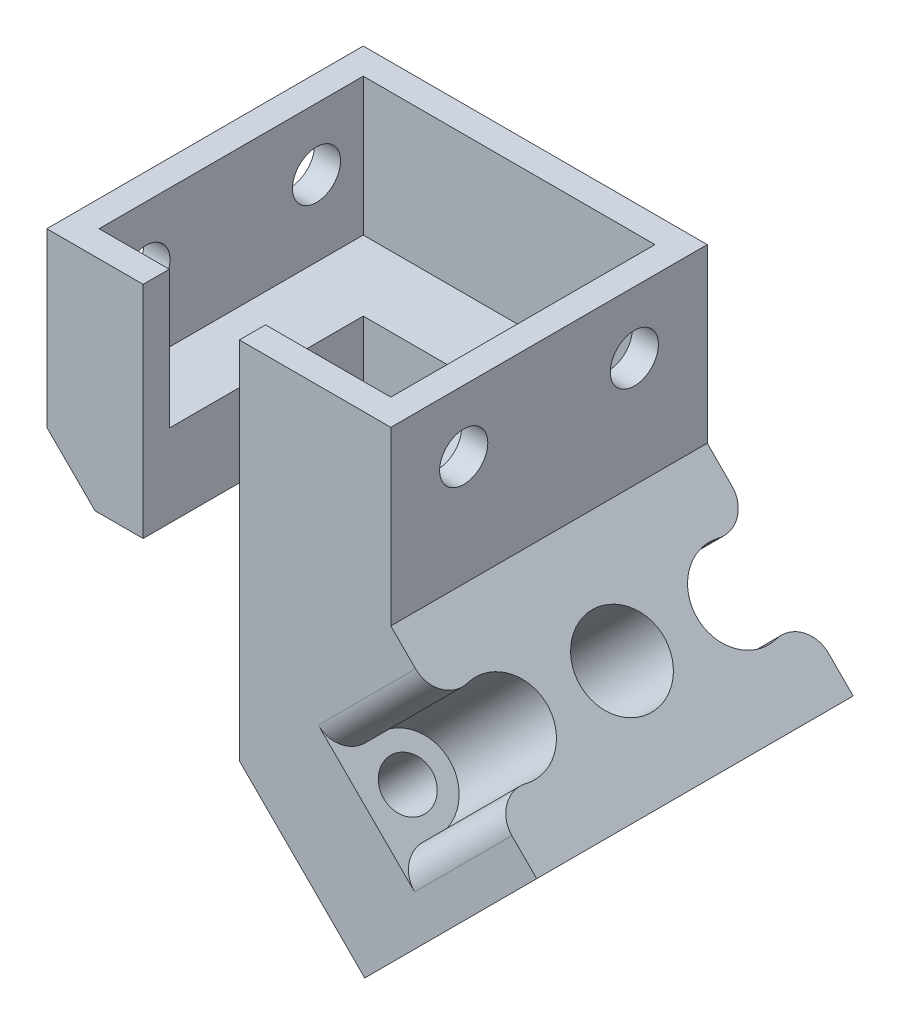
ISO-10303-21;
HEADER;
FILE_DESCRIPTION(('STEP AP214'),'2;1');
FILE_NAME('part.step','',(''),(''),'','','');
FILE_SCHEMA(('AUTOMOTIVE_DESIGN { 1 0 10303 214 1 1 1 1 }'));
ENDSEC;
DATA;
#1=APPLICATION_CONTEXT('core data for automotive mechanical design processes');
#2=APPLICATION_PROTOCOL_DEFINITION('international standard','automotive_design',2000,#1);
#3=PRODUCT_CONTEXT('',#1,'mechanical');
#4=PRODUCT('Part','Part','',(#3));
#5=PRODUCT_RELATED_PRODUCT_CATEGORY('part','',(#4));
#6=PRODUCT_DEFINITION_FORMATION('','',#4);
#7=PRODUCT_DEFINITION_CONTEXT('part definition',#1,'design');
#8=PRODUCT_DEFINITION('design','',#6,#7);
#9=PRODUCT_DEFINITION_SHAPE('','',#8);
#10=(LENGTH_UNIT() NAMED_UNIT(*) SI_UNIT(.MILLI.,.METRE.));
#11=(NAMED_UNIT(*) PLANE_ANGLE_UNIT() SI_UNIT($,.RADIAN.));
#12=(NAMED_UNIT(*) SI_UNIT($,.STERADIAN.) SOLID_ANGLE_UNIT());
#13=UNCERTAINTY_MEASURE_WITH_UNIT(LENGTH_MEASURE(1.E-05),#10,'distance_accuracy_value','');
#14=(GEOMETRIC_REPRESENTATION_CONTEXT(3) GLOBAL_UNCERTAINTY_ASSIGNED_CONTEXT((#13)) GLOBAL_UNIT_ASSIGNED_CONTEXT((#10,
#11,#12)) REPRESENTATION_CONTEXT('',''));
#15=CARTESIAN_POINT('',(0.,0.,0.));
#16=DIRECTION('',(0.,0.,1.));
#17=DIRECTION('',(1.,0.,0.));
#18=AXIS2_PLACEMENT_3D('',#15,#16,#17);
#19=CARTESIAN_POINT('',(0.,12.5,0.));
#20=DIRECTION('',(0.,0.,-1.));
#21=DIRECTION('',(-1.,0.,0.));
#22=AXIS2_PLACEMENT_3D('',#19,#20,#21);
#23=PLANE('',#22);
#24=DIRECTION('',(0.707106781186544,-0.707106781186551,0.));
#25=VECTOR('',#24,1.);
#26=CARTESIAN_POINT('',(0.,0.,0.));
#27=LINE('',#26,#25);
#28=CARTESIAN_POINT('',(0.,0.,0.));
#29=VERTEX_POINT('',#28);
#30=CARTESIAN_POINT('',(3.5,-3.5,0.));
#31=VERTEX_POINT('',#30);
#32=EDGE_CURVE('E371',#29,#31,#27,.T.);
#33=ORIENTED_EDGE('',*,*,#32,.T.);
#34=DIRECTION('',(-1.,0.,0.));
#35=VECTOR('',#34,1.);
#36=CARTESIAN_POINT('',(14.,-3.5,0.));
#37=LINE('',#36,#35);
#38=CARTESIAN_POINT('',(6.99999999999999,-3.5,0.));
#39=VERTEX_POINT('',#38);
#40=EDGE_CURVE('E219',#39,#31,#37,.T.);
#41=ORIENTED_EDGE('',*,*,#40,.F.);
#42=DIRECTION('',(0.,1.,0.));
#43=VECTOR('',#42,1.);
#44=CARTESIAN_POINT('',(6.99999999999999,-3.5,0.));
#45=LINE('',#44,#43);
#46=CARTESIAN_POINT('',(6.99999999999999,12.5,0.));
#47=VERTEX_POINT('',#46);
#48=EDGE_CURVE('E345',#39,#47,#45,.T.);
#49=ORIENTED_EDGE('',*,*,#48,.T.);
#50=DIRECTION('',(1.,0.,0.));
#51=VECTOR('',#50,1.);
#52=CARTESIAN_POINT('',(0.,12.5,0.));
#53=LINE('',#52,#51);
#54=CARTESIAN_POINT('',(0.,12.5,0.));
#55=VERTEX_POINT('',#54);
#56=EDGE_CURVE('E431',#55,#47,#53,.T.);
#57=ORIENTED_EDGE('',*,*,#56,.F.);
#58=DIRECTION('',(0.,-1.,0.));
#59=VECTOR('',#58,1.);
#60=CARTESIAN_POINT('',(0.,12.5,0.));
#61=LINE('',#60,#59);
#62=EDGE_CURVE('E459',#55,#29,#61,.T.);
#63=ORIENTED_EDGE('',*,*,#62,.T.);
#64=EDGE_LOOP('',(#33,#41,#49,#57,#63));
#65=FACE_BOUND('',#64,.T.);
#66=ADVANCED_FACE('F44',(#65),#23,.F.);
#67=CARTESIAN_POINT('',(6.24999999999981,-29.3566017177981,-11.5));
#68=DIRECTION('',(0.707106781186551,0.707106781186544,0.));
#69=DIRECTION('',(-0.707106781186544,0.707106781186551,0.));
#70=AXIS2_PLACEMENT_3D('',#67,#68,#69);
#71=CYLINDRICAL_SURFACE('',#70,1.75);
#72=CARTESIAN_POINT('',(17.803300858899,-17.8033008588991,-11.5));
#73=DIRECTION('',(-0.707106781186551,-0.707106781186544,0.));
#74=DIRECTION('',(0.707106781186544,-0.707106781186551,0.));
#75=AXIS2_PLACEMENT_3D('',#72,#73,#74);
#76=CIRCLE('',#75,1.75);
#77=CARTESIAN_POINT('',(19.0407377259754,-19.0407377259756,-11.5));
#78=VERTEX_POINT('',#77);
#79=EDGE_CURVE('E304',#78,#78,#76,.T.);
#80=ORIENTED_EDGE('',*,*,#79,.T.);
#81=EDGE_LOOP('',(#80));
#82=FACE_BOUND('',#81,.T.);
#83=CARTESIAN_POINT('',(23.2322330470336,-12.3743686707646,-11.5));
#84=DIRECTION('',(0.707106781186551,0.707106781186544,0.));
#85=DIRECTION('',(-0.707106781186544,0.707106781186551,0.));
#86=AXIS2_PLACEMENT_3D('',#83,#84,#85);
#87=CIRCLE('',#86,1.75);
#88=CARTESIAN_POINT('',(21.9947961799571,-11.1369318036881,-11.5));
#89=VERTEX_POINT('',#88);
#90=EDGE_CURVE('E303',#89,#89,#87,.F.);
#91=ORIENTED_EDGE('',*,*,#90,.F.);
#92=EDGE_LOOP('',(#91));
#93=FACE_BOUND('',#92,.T.);
#94=ADVANCED_FACE('F552',(#82,#93),#71,.F.);
#95=CARTESIAN_POINT('',(6.24999999999981,-29.3566017177981,-3.));
#96=DIRECTION('',(0.707106781186551,0.707106781186544,0.));
#97=DIRECTION('',(-0.707106781186544,0.707106781186551,0.));
#98=AXIS2_PLACEMENT_3D('',#95,#96,#97);
#99=CYLINDRICAL_SURFACE('',#98,1.75);
#100=CARTESIAN_POINT('',(17.803300858899,-17.8033008588991,-3.));
#101=DIRECTION('',(-0.707106781186551,-0.707106781186544,0.));
#102=DIRECTION('',(0.707106781186544,-0.707106781186551,0.));
#103=AXIS2_PLACEMENT_3D('',#100,#101,#102);
#104=CIRCLE('',#103,1.75);
#105=CARTESIAN_POINT('',(19.0407377259754,-19.0407377259756,-3.));
#106=VERTEX_POINT('',#105);
#107=EDGE_CURVE('E308',#106,#106,#104,.T.);
#108=ORIENTED_EDGE('',*,*,#107,.T.);
#109=EDGE_LOOP('',(#108));
#110=FACE_BOUND('',#109,.T.);
#111=CARTESIAN_POINT('',(23.2322330470336,-12.3743686707646,-3.));
#112=DIRECTION('',(0.707106781186551,0.707106781186544,0.));
#113=DIRECTION('',(-0.707106781186544,0.707106781186551,0.));
#114=AXIS2_PLACEMENT_3D('',#111,#112,#113);
#115=CIRCLE('',#114,1.75);
#116=CARTESIAN_POINT('',(21.9947961799571,-11.1369318036881,-3.));
#117=VERTEX_POINT('',#116);
#118=EDGE_CURVE('E299',#117,#117,#115,.F.);
#119=ORIENTED_EDGE('',*,*,#118,.F.);
#120=EDGE_LOOP('',(#119));
#121=FACE_BOUND('',#120,.T.);
#122=ADVANCED_FACE('F559',(#110,#121),#99,.F.);
#123=CARTESIAN_POINT('',(6.24999999999981,-29.3566017177981,-20.));
#124=DIRECTION('',(0.707106781186551,0.707106781186544,0.));
#125=DIRECTION('',(-0.707106781186544,0.707106781186551,0.));
#126=AXIS2_PLACEMENT_3D('',#123,#124,#125);
#127=CYLINDRICAL_SURFACE('',#126,1.75);
#128=CARTESIAN_POINT('',(17.803300858899,-17.8033008588991,-20.));
#129=DIRECTION('',(-0.707106781186551,-0.707106781186544,0.));
#130=DIRECTION('',(0.707106781186544,-0.707106781186551,0.));
#131=AXIS2_PLACEMENT_3D('',#128,#129,#130);
#132=CIRCLE('',#131,1.75);
#133=CARTESIAN_POINT('',(19.0407377259754,-19.0407377259756,-20.));
#134=VERTEX_POINT('',#133);
#135=EDGE_CURVE('E312',#134,#134,#132,.T.);
#136=ORIENTED_EDGE('',*,*,#135,.T.);
#137=EDGE_LOOP('',(#136));
#138=FACE_BOUND('',#137,.T.);
#139=CARTESIAN_POINT('',(23.2322330470336,-12.3743686707646,-20.));
#140=DIRECTION('',(0.707106781186551,0.707106781186544,0.));
#141=DIRECTION('',(-0.707106781186544,0.707106781186551,0.));
#142=AXIS2_PLACEMENT_3D('',#139,#140,#141);
#143=CIRCLE('',#142,1.75);
#144=CARTESIAN_POINT('',(21.9947961799571,-11.1369318036881,-20.));
#145=VERTEX_POINT('',#144);
#146=EDGE_CURVE('E277',#145,#145,#143,.F.);
#147=ORIENTED_EDGE('',*,*,#146,.F.);
#148=EDGE_LOOP('',(#147));
#149=FACE_BOUND('',#148,.T.);
#150=ADVANCED_FACE('F664',(#138,#149),#127,.F.);
#151=CARTESIAN_POINT('',(1.9,2.5,-1.9));
#152=DIRECTION('',(0.,0.,1.));
#153=DIRECTION('',(1.,0.,0.));
#154=AXIS2_PLACEMENT_3D('',#151,#152,#153);
#155=PLANE('',#154);
#156=DIRECTION('',(1.,0.,0.));
#157=VECTOR('',#156,1.);
#158=CARTESIAN_POINT('',(1.9,12.5,-1.9));
#159=LINE('',#158,#157);
#160=CARTESIAN_POINT('',(1.9,12.5,-1.9));
#161=VERTEX_POINT('',#160);
#162=CARTESIAN_POINT('',(6.99999999999999,12.5,-1.9));
#163=VERTEX_POINT('',#162);
#164=EDGE_CURVE('E400',#161,#163,#159,.T.);
#165=ORIENTED_EDGE('',*,*,#164,.T.);
#166=DIRECTION('',(0.,-1.,0.));
#167=VECTOR('',#166,1.);
#168=CARTESIAN_POINT('',(6.99999999999999,2.5,-1.9));
#169=LINE('',#168,#167);
#170=CARTESIAN_POINT('',(6.99999999999999,2.5,-1.9));
#171=VERTEX_POINT('',#170);
#172=EDGE_CURVE('E366',#163,#171,#169,.T.);
#173=ORIENTED_EDGE('',*,*,#172,.T.);
#174=DIRECTION('',(1.,0.,0.));
#175=VECTOR('',#174,1.);
#176=CARTESIAN_POINT('',(1.9,2.5,-1.9));
#177=LINE('',#176,#175);
#178=CARTESIAN_POINT('',(1.9,2.5,-1.9));
#179=VERTEX_POINT('',#178);
#180=EDGE_CURVE('E384',#179,#171,#177,.T.);
#181=ORIENTED_EDGE('',*,*,#180,.F.);
#182=DIRECTION('',(0.,1.,0.));
#183=VECTOR('',#182,1.);
#184=CARTESIAN_POINT('',(1.9,2.5,-1.9));
#185=LINE('',#184,#183);
#186=EDGE_CURVE('E396',#179,#161,#185,.T.);
#187=ORIENTED_EDGE('',*,*,#186,.T.);
#188=EDGE_LOOP('',(#165,#173,#181,#187));
#189=FACE_BOUND('',#188,.T.);
#190=ADVANCED_FACE('F574',(#189),#155,.F.);
#191=CARTESIAN_POINT('',(0.,12.5,0.));
#192=DIRECTION('',(1.,0.,0.));
#193=DIRECTION('',(0.,0.,-1.));
#194=AXIS2_PLACEMENT_3D('',#191,#192,#193);
#195=PLANE('',#194);
#196=CARTESIAN_POINT('',(0.,8.,-5.29999999999999));
#197=DIRECTION('',(1.,0.,0.));
#198=DIRECTION('',(0.,0.,-1.));
#199=AXIS2_PLACEMENT_3D('',#196,#197,#198);
#200=CIRCLE('',#199,1.75);
#201=CARTESIAN_POINT('',(0.,8.,-7.04999999999999));
#202=VERTEX_POINT('',#201);
#203=EDGE_CURVE('E249',#202,#202,#200,.T.);
#204=ORIENTED_EDGE('',*,*,#203,.T.);
#205=EDGE_LOOP('',(#204));
#206=FACE_BOUND('',#205,.T.);
#207=CARTESIAN_POINT('',(0.,8.,-17.7));
#208=DIRECTION('',(1.,0.,0.));
#209=DIRECTION('',(0.,0.,1.));
#210=AXIS2_PLACEMENT_3D('',#207,#208,#209);
#211=CIRCLE('',#210,1.75);
#212=CARTESIAN_POINT('',(0.,8.,-15.95));
#213=VERTEX_POINT('',#212);
#214=EDGE_CURVE('E242',#213,#213,#211,.T.);
#215=ORIENTED_EDGE('',*,*,#214,.T.);
#216=EDGE_LOOP('',(#215));
#217=FACE_BOUND('',#216,.T.);
#218=DIRECTION('',(0.,0.,1.));
#219=VECTOR('',#218,1.);
#220=CARTESIAN_POINT('',(0.,0.,0.));
#221=LINE('',#220,#219);
#222=CARTESIAN_POINT('',(0.,0.,-23.));
#223=VERTEX_POINT('',#222);
#224=EDGE_CURVE('E414',#223,#29,#221,.T.);
#225=ORIENTED_EDGE('',*,*,#224,.T.);
#226=ORIENTED_EDGE('',*,*,#62,.F.);
#227=DIRECTION('',(0.,0.,1.));
#228=VECTOR('',#227,1.);
#229=CARTESIAN_POINT('',(0.,12.5,0.));
#230=LINE('',#229,#228);
#231=CARTESIAN_POINT('',(0.,12.5,-23.));
#232=VERTEX_POINT('',#231);
#233=EDGE_CURVE('E425',#232,#55,#230,.T.);
#234=ORIENTED_EDGE('',*,*,#233,.F.);
#235=DIRECTION('',(0.,-1.,0.));
#236=VECTOR('',#235,1.);
#237=CARTESIAN_POINT('',(0.,12.5,-23.));
#238=LINE('',#237,#236);
#239=EDGE_CURVE('E441',#232,#223,#238,.T.);
#240=ORIENTED_EDGE('',*,*,#239,.T.);
#241=EDGE_LOOP('',(#225,#226,#234,#240));
#242=FACE_BOUND('',#241,.T.);
#243=ADVANCED_FACE('F566',(#206,#217,#242),#195,.F.);
#244=DIRECTION('',(0.,1.,0.));
#245=VECTOR('',#244,1.);
#246=CARTESIAN_POINT('',(14.,-3.5,0.));
#247=LINE('',#246,#245);
#248=CARTESIAN_POINT('',(14.,-14.,0.));
#249=VERTEX_POINT('',#248);
#250=CARTESIAN_POINT('',(14.,12.5,0.));
#251=VERTEX_POINT('',#250);
#252=EDGE_CURVE('E357',#249,#251,#247,.T.);
#253=ORIENTED_EDGE('',*,*,#252,.F.);
#254=CARTESIAN_POINT('',(23.106601717798,-23.1066017177983,0.));
#255=VERTEX_POINT('',#254);
#256=EDGE_CURVE('E370',#249,#255,#27,.T.);
#257=ORIENTED_EDGE('',*,*,#256,.T.);
#258=DIRECTION('',(0.707106781186551,0.707106781186544,0.));
#259=VECTOR('',#258,1.);
#260=CARTESIAN_POINT('',(35.6066017177981,-10.6066017177983,0.));
#261=LINE('',#260,#259);
#262=CARTESIAN_POINT('',(35.6066017177981,-10.6066017177983,0.));
#263=VERTEX_POINT('',#262);
#264=EDGE_CURVE('E316',#255,#263,#261,.T.);
#265=ORIENTED_EDGE('',*,*,#264,.T.);
#266=DIRECTION('',(-0.707106781186544,0.707106781186551,0.));
#267=VECTOR('',#266,1.);
#268=CARTESIAN_POINT('',(35.6066017177981,-10.6066017177983,0.));
#269=LINE('',#268,#267);
#270=CARTESIAN_POINT('',(33.8034794257725,-8.80347942577256,0.));
#271=VERTEX_POINT('',#270);
#272=EDGE_CURVE('E327',#263,#271,#269,.T.);
#273=ORIENTED_EDGE('',*,*,#272,.T.);
#274=DIRECTION('',(0.707106781186551,0.707106781186544,0.));
#275=VECTOR('',#274,1.);
#276=CARTESIAN_POINT('',(27.5534794257723,-15.0534794257726,0.));
#277=LINE('',#276,#275);
#278=CARTESIAN_POINT('',(26.732411613907,-15.874547237638,0.));
#279=VERTEX_POINT('',#278);
#280=EDGE_CURVE('E485',#271,#279,#277,.F.);
#281=ORIENTED_EDGE('',*,*,#280,.T.);
#282=DIRECTION('',(0.707106781186544,-0.707106781186551,0.));
#283=VECTOR('',#282,1.);
#284=CARTESIAN_POINT('',(-0.82106781186538,11.6789321881346,0.));
#285=LINE('',#284,#283);
#286=CARTESIAN_POINT('',(19.7320544801602,-8.87419010389114,0.));
#287=VERTEX_POINT('',#286);
#288=EDGE_CURVE('E300',#287,#279,#285,.T.);
#289=ORIENTED_EDGE('',*,*,#288,.F.);
#290=DIRECTION('',(0.707106781186551,0.707106781186544,0.));
#291=VECTOR('',#290,1.);
#292=CARTESIAN_POINT('',(20.5531222920256,-8.05312229202577,0.));
#293=LINE('',#292,#291);
#294=CARTESIAN_POINT('',(26.8031222920257,-1.8031222920257,0.));
#295=VERTEX_POINT('',#294);
#296=EDGE_CURVE('E472',#287,#295,#293,.T.);
#297=ORIENTED_EDGE('',*,*,#296,.T.);
#298=CARTESIAN_POINT('',(25.,0.,0.));
#299=VERTEX_POINT('',#298);
#300=EDGE_CURVE('E326',#295,#299,#269,.T.);
#301=ORIENTED_EDGE('',*,*,#300,.T.);
#302=DIRECTION('',(0.,-1.,0.));
#303=VECTOR('',#302,1.);
#304=CARTESIAN_POINT('',(25.,12.5,0.));
#305=LINE('',#304,#303);
#306=CARTESIAN_POINT('',(25.,12.5,0.));
#307=VERTEX_POINT('',#306);
#308=EDGE_CURVE('E455',#307,#299,#305,.T.);
#309=ORIENTED_EDGE('',*,*,#308,.F.);
#310=EDGE_CURVE('E429',#251,#307,#53,.T.);
#311=ORIENTED_EDGE('',*,*,#310,.F.);
#312=EDGE_LOOP('',(#253,#257,#265,#273,#281,#289,#297,#301,#309,#311));
#313=FACE_BOUND('',#312,.T.);
#314=ADVANCED_FACE('F555',(#313),#23,.F.);
#315=CARTESIAN_POINT('',(25.,12.5,0.));
#316=DIRECTION('',(-1.,0.,0.));
#317=DIRECTION('',(0.,0.,1.));
#318=AXIS2_PLACEMENT_3D('',#315,#316,#317);
#319=PLANE('',#318);
#320=CARTESIAN_POINT('',(25.,8.,-5.3));
#321=DIRECTION('',(1.,0.,0.));
#322=DIRECTION('',(0.,0.,-1.));
#323=AXIS2_PLACEMENT_3D('',#320,#321,#322);
#324=CIRCLE('',#323,1.75);
#325=CARTESIAN_POINT('',(25.,8.,-7.05));
#326=VERTEX_POINT('',#325);
#327=EDGE_CURVE('E254',#326,#326,#324,.T.);
#328=ORIENTED_EDGE('',*,*,#327,.F.);
#329=EDGE_LOOP('',(#328));
#330=FACE_BOUND('',#329,.T.);
#331=CARTESIAN_POINT('',(25.,8.,-17.7));
#332=DIRECTION('',(1.,0.,0.));
#333=DIRECTION('',(0.,0.,1.));
#334=AXIS2_PLACEMENT_3D('',#331,#332,#333);
#335=CIRCLE('',#334,1.75);
#336=CARTESIAN_POINT('',(25.,8.,-15.95));
#337=VERTEX_POINT('',#336);
#338=EDGE_CURVE('E246',#337,#337,#335,.T.);
#339=ORIENTED_EDGE('',*,*,#338,.F.);
#340=EDGE_LOOP('',(#339));
#341=FACE_BOUND('',#340,.T.);
#342=DIRECTION('',(0.,0.,-1.));
#343=VECTOR('',#342,1.);
#344=CARTESIAN_POINT('',(25.,0.,0.));
#345=LINE('',#344,#343);
#346=CARTESIAN_POINT('',(25.,0.,-23.));
#347=VERTEX_POINT('',#346);
#348=EDGE_CURVE('E430',#299,#347,#345,.T.);
#349=ORIENTED_EDGE('',*,*,#348,.T.);
#350=DIRECTION('',(0.,-1.,0.));
#351=VECTOR('',#350,1.);
#352=CARTESIAN_POINT('',(25.,12.5,-23.));
#353=LINE('',#352,#351);
#354=CARTESIAN_POINT('',(25.,12.5,-23.));
#355=VERTEX_POINT('',#354);
#356=EDGE_CURVE('E451',#355,#347,#353,.T.);
#357=ORIENTED_EDGE('',*,*,#356,.F.);
#358=DIRECTION('',(0.,0.,-1.));
#359=VECTOR('',#358,1.);
#360=CARTESIAN_POINT('',(25.,12.5,0.));
#361=LINE('',#360,#359);
#362=EDGE_CURVE('E435',#307,#355,#361,.T.);
#363=ORIENTED_EDGE('',*,*,#362,.F.);
#364=ORIENTED_EDGE('',*,*,#308,.T.);
#365=EDGE_LOOP('',(#349,#357,#363,#364));
#366=FACE_BOUND('',#365,.T.);
#367=ADVANCED_FACE('F565',(#330,#341,#366),#319,.F.);
#368=CARTESIAN_POINT('',(0.,12.5,-23.));
#369=DIRECTION('',(0.,0.,1.));
#370=DIRECTION('',(1.,0.,0.));
#371=AXIS2_PLACEMENT_3D('',#368,#369,#370);
#372=PLANE('',#371);
#373=DIRECTION('',(0.707106781186544,-0.707106781186551,0.));
#374=VECTOR('',#373,1.);
#375=CARTESIAN_POINT('',(35.6066017177981,-10.6066017177983,-23.));
#376=LINE('',#375,#374);
#377=CARTESIAN_POINT('',(26.8031222920257,-1.8031222920257,-23.));
#378=VERTEX_POINT('',#377);
#379=EDGE_CURVE('E337',#347,#378,#376,.T.);
#380=ORIENTED_EDGE('',*,*,#379,.T.);
#381=DIRECTION('',(0.707106781186551,0.707106781186544,0.));
#382=VECTOR('',#381,1.);
#383=CARTESIAN_POINT('',(20.5531222920255,-8.05312229202577,-23.));
#384=LINE('',#383,#382);
#385=CARTESIAN_POINT('',(19.7320544801602,-8.87419010389114,-23.));
#386=VERTEX_POINT('',#385);
#387=EDGE_CURVE('E511',#378,#386,#384,.F.);
#388=ORIENTED_EDGE('',*,*,#387,.T.);
#389=DIRECTION('',(-0.707106781186544,0.707106781186551,0.));
#390=VECTOR('',#389,1.);
#391=CARTESIAN_POINT('',(-0.821067811865385,11.6789321881346,-23.));
#392=LINE('',#391,#390);
#393=CARTESIAN_POINT('',(26.732411613907,-15.874547237638,-23.));
#394=VERTEX_POINT('',#393);
#395=EDGE_CURVE('E296',#394,#386,#392,.T.);
#396=ORIENTED_EDGE('',*,*,#395,.F.);
#397=DIRECTION('',(0.707106781186551,0.707106781186544,0.));
#398=VECTOR('',#397,1.);
#399=CARTESIAN_POINT('',(27.5534794257723,-15.0534794257726,-23.));
#400=LINE('',#399,#398);
#401=CARTESIAN_POINT('',(33.8034794257725,-8.80347942577256,-23.));
#402=VERTEX_POINT('',#401);
#403=EDGE_CURVE('E507',#394,#402,#400,.T.);
#404=ORIENTED_EDGE('',*,*,#403,.T.);
#405=CARTESIAN_POINT('',(35.6066017177981,-10.6066017177983,-23.));
#406=VERTEX_POINT('',#405);
#407=EDGE_CURVE('E321',#402,#406,#376,.T.);
#408=ORIENTED_EDGE('',*,*,#407,.T.);
#409=DIRECTION('',(-0.707106781186551,-0.707106781186544,0.));
#410=VECTOR('',#409,1.);
#411=CARTESIAN_POINT('',(35.6066017177981,-10.6066017177983,-23.));
#412=LINE('',#411,#410);
#413=CARTESIAN_POINT('',(23.106601717798,-23.1066017177983,-23.));
#414=VERTEX_POINT('',#413);
#415=EDGE_CURVE('E317',#406,#414,#412,.T.);
#416=ORIENTED_EDGE('',*,*,#415,.T.);
#417=DIRECTION('',(-0.707106781186544,0.707106781186551,0.));
#418=VECTOR('',#417,1.);
#419=CARTESIAN_POINT('',(0.,0.,-23.));
#420=LINE('',#419,#418);
#421=EDGE_CURVE('E374',#414,#223,#420,.T.);
#422=ORIENTED_EDGE('',*,*,#421,.T.);
#423=ORIENTED_EDGE('',*,*,#239,.F.);
#424=DIRECTION('',(-1.,0.,0.));
#425=VECTOR('',#424,1.);
#426=CARTESIAN_POINT('',(0.,12.5,-23.));
#427=LINE('',#426,#425);
#428=EDGE_CURVE('E438',#355,#232,#427,.T.);
#429=ORIENTED_EDGE('',*,*,#428,.F.);
#430=ORIENTED_EDGE('',*,*,#356,.T.);
#431=EDGE_LOOP('',(#380,#388,#396,#404,#408,#416,#422,#423,#429,#430));
#432=FACE_BOUND('',#431,.T.);
#433=ADVANCED_FACE('F572',(#432),#372,.F.);
#434=CARTESIAN_POINT('',(0.,12.5,0.));
#435=DIRECTION('',(0.,-1.,0.));
#436=DIRECTION('',(0.,0.,-1.));
#437=AXIS2_PLACEMENT_3D('',#434,#435,#436);
#438=PLANE('',#437);
#439=ORIENTED_EDGE('',*,*,#56,.T.);
#440=DIRECTION('',(0.,0.,1.));
#441=VECTOR('',#440,1.);
#442=CARTESIAN_POINT('',(6.99999999999999,12.5,0.));
#443=LINE('',#442,#441);
#444=EDGE_CURVE('E341',#163,#47,#443,.T.);
#445=ORIENTED_EDGE('',*,*,#444,.F.);
#446=ORIENTED_EDGE('',*,*,#164,.F.);
#447=DIRECTION('',(0.,0.,1.));
#448=VECTOR('',#447,1.);
#449=CARTESIAN_POINT('',(1.89999999999999,12.5,-21.1));
#450=LINE('',#449,#448);
#451=CARTESIAN_POINT('',(1.89999999999999,12.5,-21.1));
#452=VERTEX_POINT('',#451);
#453=EDGE_CURVE('E377',#452,#161,#450,.T.);
#454=ORIENTED_EDGE('',*,*,#453,.F.);
#455=DIRECTION('',(-1.,0.,0.));
#456=VECTOR('',#455,1.);
#457=CARTESIAN_POINT('',(1.89999999999999,12.5,-21.1));
#458=LINE('',#457,#456);
#459=CARTESIAN_POINT('',(23.1,12.5,-21.1));
#460=VERTEX_POINT('',#459);
#461=EDGE_CURVE('E383',#460,#452,#458,.T.);
#462=ORIENTED_EDGE('',*,*,#461,.F.);
#463=DIRECTION('',(0.,0.,-1.));
#464=VECTOR('',#463,1.);
#465=CARTESIAN_POINT('',(23.1,12.5,-21.1));
#466=LINE('',#465,#464);
#467=CARTESIAN_POINT('',(23.1,12.5,-1.9));
#468=VERTEX_POINT('',#467);
#469=EDGE_CURVE('E404',#468,#460,#466,.T.);
#470=ORIENTED_EDGE('',*,*,#469,.F.);
#471=CARTESIAN_POINT('',(14.,12.5,-1.9));
#472=VERTEX_POINT('',#471);
#473=EDGE_CURVE('E399',#472,#468,#159,.T.);
#474=ORIENTED_EDGE('',*,*,#473,.F.);
#475=DIRECTION('',(0.,0.,-1.));
#476=VECTOR('',#475,1.);
#477=CARTESIAN_POINT('',(14.,12.5,0.));
#478=LINE('',#477,#476);
#479=EDGE_CURVE('E346',#251,#472,#478,.T.);
#480=ORIENTED_EDGE('',*,*,#479,.F.);
#481=ORIENTED_EDGE('',*,*,#310,.T.);
#482=ORIENTED_EDGE('',*,*,#362,.T.);
#483=ORIENTED_EDGE('',*,*,#428,.T.);
#484=ORIENTED_EDGE('',*,*,#233,.T.);
#485=EDGE_LOOP('',(#439,#445,#446,#454,#462,#470,#474,#480,#481,#482,#483,#484));
#486=FACE_BOUND('',#485,.T.);
#487=ADVANCED_FACE('F609',(#486),#438,.F.);
#488=CARTESIAN_POINT('',(1.89999999999999,2.5,-21.1));
#489=DIRECTION('',(-1.,0.,0.));
#490=DIRECTION('',(0.,0.,1.));
#491=AXIS2_PLACEMENT_3D('',#488,#489,#490);
#492=PLANE('',#491);
#493=CARTESIAN_POINT('',(1.9,8.,-5.29999999999999));
#494=DIRECTION('',(-1.,0.,0.));
#495=DIRECTION('',(0.,0.,1.));
#496=AXIS2_PLACEMENT_3D('',#493,#494,#495);
#497=CIRCLE('',#496,1.75);
#498=CARTESIAN_POINT('',(1.9,8.,-3.54999999999999));
#499=VERTEX_POINT('',#498);
#500=EDGE_CURVE('E265',#499,#499,#497,.T.);
#501=ORIENTED_EDGE('',*,*,#500,.T.);
#502=EDGE_LOOP('',(#501));
#503=FACE_BOUND('',#502,.T.);
#504=CARTESIAN_POINT('',(1.89999999999999,8.,-17.7));
#505=DIRECTION('',(-1.,0.,0.));
#506=DIRECTION('',(0.,0.,1.));
#507=AXIS2_PLACEMENT_3D('',#504,#505,#506);
#508=CIRCLE('',#507,1.75);
#509=CARTESIAN_POINT('',(1.89999999999999,8.,-15.95));
#510=VERTEX_POINT('',#509);
#511=EDGE_CURVE('E261',#510,#510,#508,.T.);
#512=ORIENTED_EDGE('',*,*,#511,.T.);
#513=EDGE_LOOP('',(#512));
#514=FACE_BOUND('',#513,.T.);
#515=ORIENTED_EDGE('',*,*,#453,.T.);
#516=ORIENTED_EDGE('',*,*,#186,.F.);
#517=DIRECTION('',(0.,0.,1.));
#518=VECTOR('',#517,1.);
#519=CARTESIAN_POINT('',(1.89999999999999,2.5,-21.1));
#520=LINE('',#519,#518);
#521=CARTESIAN_POINT('',(1.89999999999999,2.5,-21.1));
#522=VERTEX_POINT('',#521);
#523=EDGE_CURVE('E378',#522,#179,#520,.T.);
#524=ORIENTED_EDGE('',*,*,#523,.F.);
#525=DIRECTION('',(0.,1.,0.));
#526=VECTOR('',#525,1.);
#527=CARTESIAN_POINT('',(1.89999999999999,2.5,-21.1));
#528=LINE('',#527,#526);
#529=EDGE_CURVE('E411',#522,#452,#528,.T.);
#530=ORIENTED_EDGE('',*,*,#529,.T.);
#531=EDGE_LOOP('',(#515,#516,#524,#530));
#532=FACE_BOUND('',#531,.T.);
#533=ADVANCED_FACE('F602',(#503,#514,#532),#492,.F.);
#534=CARTESIAN_POINT('',(1.89999999999999,2.5,-21.1));
#535=DIRECTION('',(0.,0.,-1.));
#536=DIRECTION('',(-1.,0.,0.));
#537=AXIS2_PLACEMENT_3D('',#534,#535,#536);
#538=PLANE('',#537);
#539=ORIENTED_EDGE('',*,*,#461,.T.);
#540=ORIENTED_EDGE('',*,*,#529,.F.);
#541=DIRECTION('',(-1.,0.,0.));
#542=VECTOR('',#541,1.);
#543=CARTESIAN_POINT('',(1.89999999999999,2.5,-21.1));
#544=LINE('',#543,#542);
#545=CARTESIAN_POINT('',(23.1,2.5,-21.1));
#546=VERTEX_POINT('',#545);
#547=EDGE_CURVE('E392',#546,#522,#544,.T.);
#548=ORIENTED_EDGE('',*,*,#547,.F.);
#549=DIRECTION('',(0.,1.,0.));
#550=VECTOR('',#549,1.);
#551=CARTESIAN_POINT('',(23.1,2.5,-21.1));
#552=LINE('',#551,#550);
#553=EDGE_CURVE('E415',#546,#460,#552,.T.);
#554=ORIENTED_EDGE('',*,*,#553,.T.);
#555=EDGE_LOOP('',(#539,#540,#548,#554));
#556=FACE_BOUND('',#555,.T.);
#557=ADVANCED_FACE('F593',(#556),#538,.F.);
#558=CARTESIAN_POINT('',(23.1,2.5,-21.1));
#559=DIRECTION('',(1.,0.,0.));
#560=DIRECTION('',(0.,0.,-1.));
#561=AXIS2_PLACEMENT_3D('',#558,#559,#560);
#562=PLANE('',#561);
#563=CARTESIAN_POINT('',(23.1,8.,-5.3));
#564=DIRECTION('',(1.,0.,0.));
#565=DIRECTION('',(0.,0.,-1.));
#566=AXIS2_PLACEMENT_3D('',#563,#564,#565);
#567=CIRCLE('',#566,1.75);
#568=CARTESIAN_POINT('',(23.1,8.,-7.05));
#569=VERTEX_POINT('',#568);
#570=EDGE_CURVE('E48',#569,#569,#567,.T.);
#571=ORIENTED_EDGE('',*,*,#570,.T.);
#572=EDGE_LOOP('',(#571));
#573=FACE_BOUND('',#572,.T.);
#574=CARTESIAN_POINT('',(23.1,8.,-17.7));
#575=DIRECTION('',(1.,0.,0.));
#576=DIRECTION('',(0.,0.,-1.));
#577=AXIS2_PLACEMENT_3D('',#574,#575,#576);
#578=CIRCLE('',#577,1.75);
#579=CARTESIAN_POINT('',(23.1,8.,-19.45));
#580=VERTEX_POINT('',#579);
#581=EDGE_CURVE('E253',#580,#580,#578,.T.);
#582=ORIENTED_EDGE('',*,*,#581,.T.);
#583=EDGE_LOOP('',(#582));
#584=FACE_BOUND('',#583,.T.);
#585=ORIENTED_EDGE('',*,*,#469,.T.);
#586=ORIENTED_EDGE('',*,*,#553,.F.);
#587=DIRECTION('',(0.,0.,-1.));
#588=VECTOR('',#587,1.);
#589=CARTESIAN_POINT('',(23.1,2.5,-21.1));
#590=LINE('',#589,#588);
#591=CARTESIAN_POINT('',(23.1,2.5,-1.9));
#592=VERTEX_POINT('',#591);
#593=EDGE_CURVE('E388',#592,#546,#590,.T.);
#594=ORIENTED_EDGE('',*,*,#593,.F.);
#595=DIRECTION('',(0.,1.,0.));
#596=VECTOR('',#595,1.);
#597=CARTESIAN_POINT('',(23.1,2.5,-1.9));
#598=LINE('',#597,#596);
#599=EDGE_CURVE('E418',#592,#468,#598,.T.);
#600=ORIENTED_EDGE('',*,*,#599,.T.);
#601=EDGE_LOOP('',(#585,#586,#594,#600));
#602=FACE_BOUND('',#601,.T.);
#603=ADVANCED_FACE('F532',(#573,#584,#602),#562,.F.);
#604=CARTESIAN_POINT('',(14.,2.5,-1.9));
#605=VERTEX_POINT('',#604);
#606=EDGE_CURVE('E382',#605,#592,#177,.T.);
#607=ORIENTED_EDGE('',*,*,#606,.F.);
#608=DIRECTION('',(0.,1.,0.));
#609=VECTOR('',#608,1.);
#610=CARTESIAN_POINT('',(14.,2.5,-1.9));
#611=LINE('',#610,#609);
#612=EDGE_CURVE('E353',#605,#472,#611,.T.);
#613=ORIENTED_EDGE('',*,*,#612,.T.);
#614=ORIENTED_EDGE('',*,*,#473,.T.);
#615=ORIENTED_EDGE('',*,*,#599,.F.);
#616=EDGE_LOOP('',(#607,#613,#614,#615));
#617=FACE_BOUND('',#616,.T.);
#618=ADVANCED_FACE('F592',(#617),#155,.F.);
#619=CARTESIAN_POINT('',(0.,2.5,0.));
#620=DIRECTION('',(0.,1.,0.));
#621=DIRECTION('',(0.,0.,1.));
#622=AXIS2_PLACEMENT_3D('',#619,#620,#621);
#623=PLANE('',#622);
#624=DIRECTION('',(0.,0.,1.));
#625=VECTOR('',#624,1.);
#626=CARTESIAN_POINT('',(6.99999999999999,2.5,0.));
#627=LINE('',#626,#625);
#628=CARTESIAN_POINT('',(6.99999999999999,2.5,-16.));
#629=VERTEX_POINT('',#628);
#630=EDGE_CURVE('E469',#629,#171,#627,.T.);
#631=ORIENTED_EDGE('',*,*,#630,.F.);
#632=DIRECTION('',(-1.,0.,0.));
#633=VECTOR('',#632,1.);
#634=CARTESIAN_POINT('',(0.,2.5,-16.));
#635=LINE('',#634,#633);
#636=CARTESIAN_POINT('',(14.,2.5,-16.));
#637=VERTEX_POINT('',#636);
#638=EDGE_CURVE('E466',#637,#629,#635,.T.);
#639=ORIENTED_EDGE('',*,*,#638,.F.);
#640=DIRECTION('',(0.,0.,-1.));
#641=VECTOR('',#640,1.);
#642=CARTESIAN_POINT('',(14.,2.5,0.));
#643=LINE('',#642,#641);
#644=EDGE_CURVE('E463',#605,#637,#643,.T.);
#645=ORIENTED_EDGE('',*,*,#644,.F.);
#646=ORIENTED_EDGE('',*,*,#606,.T.);
#647=ORIENTED_EDGE('',*,*,#593,.T.);
#648=ORIENTED_EDGE('',*,*,#547,.T.);
#649=ORIENTED_EDGE('',*,*,#523,.T.);
#650=ORIENTED_EDGE('',*,*,#180,.T.);
#651=EDGE_LOOP('',(#631,#639,#645,#646,#647,#648,#649,#650));
#652=FACE_BOUND('',#651,.T.);
#653=ADVANCED_FACE('F599',(#652),#623,.T.);
#654=CARTESIAN_POINT('',(0.,0.,-50.9508497187474));
#655=DIRECTION('',(-0.707106781186551,-0.707106781186544,0.));
#656=DIRECTION('',(0.707106781186544,-0.707106781186551,0.));
#657=AXIS2_PLACEMENT_3D('',#654,#655,#656);
#658=PLANE('',#657);
#659=DIRECTION('',(0.,0.,1.));
#660=VECTOR('',#659,1.);
#661=CARTESIAN_POINT('',(14.,-14.,-2.));
#662=LINE('',#661,#660);
#663=CARTESIAN_POINT('',(14.,-14.,-16.));
#664=VERTEX_POINT('',#663);
#665=EDGE_CURVE('E224',#664,#249,#662,.T.);
#666=ORIENTED_EDGE('',*,*,#665,.F.);
#667=DIRECTION('',(0.707106781186548,-0.707106781186548,0.));
#668=VECTOR('',#667,1.);
#669=CARTESIAN_POINT('',(14.,-14.,-16.));
#670=LINE('',#669,#668);
#671=CARTESIAN_POINT('',(3.5,-3.5,-16.));
#672=VERTEX_POINT('',#671);
#673=EDGE_CURVE('E230',#672,#664,#670,.T.);
#674=ORIENTED_EDGE('',*,*,#673,.F.);
#675=DIRECTION('',(0.,0.,1.));
#676=VECTOR('',#675,1.);
#677=CARTESIAN_POINT('',(3.5,-3.5,-2.));
#678=LINE('',#677,#676);
#679=EDGE_CURVE('E213',#672,#31,#678,.T.);
#680=ORIENTED_EDGE('',*,*,#679,.T.);
#681=ORIENTED_EDGE('',*,*,#32,.F.);
#682=ORIENTED_EDGE('',*,*,#224,.F.);
#683=ORIENTED_EDGE('',*,*,#421,.F.);
#684=DIRECTION('',(0.,0.,1.));
#685=VECTOR('',#684,1.);
#686=CARTESIAN_POINT('',(23.106601717798,-23.1066017177983,-55.6776695296638));
#687=LINE('',#686,#685);
#688=EDGE_CURVE('E322',#414,#255,#687,.T.);
#689=ORIENTED_EDGE('',*,*,#688,.T.);
#690=ORIENTED_EDGE('',*,*,#256,.F.);
#691=EDGE_LOOP('',(#666,#674,#680,#681,#682,#683,#689,#690));
#692=FACE_BOUND('',#691,.T.);
#693=ORIENTED_EDGE('',*,*,#135,.F.);
#694=EDGE_LOOP('',(#693));
#695=FACE_BOUND('',#694,.T.);
#696=ORIENTED_EDGE('',*,*,#107,.F.);
#697=EDGE_LOOP('',(#696));
#698=FACE_BOUND('',#697,.T.);
#699=ORIENTED_EDGE('',*,*,#79,.F.);
#700=EDGE_LOOP('',(#699));
#701=FACE_BOUND('',#700,.T.);
#702=ADVANCED_FACE('F237',(#692,#695,#698,#701),#658,.T.);
#703=CARTESIAN_POINT('',(6.99999999999999,-3.5,0.));
#704=DIRECTION('',(-1.,0.,0.));
#705=DIRECTION('',(0.,0.,1.));
#706=AXIS2_PLACEMENT_3D('',#703,#704,#705);
#707=PLANE('',#706);
#708=ORIENTED_EDGE('',*,*,#444,.T.);
#709=ORIENTED_EDGE('',*,*,#48,.F.);
#710=DIRECTION('',(0.,0.,1.));
#711=VECTOR('',#710,1.);
#712=CARTESIAN_POINT('',(6.99999999999999,-3.5,0.));
#713=LINE('',#712,#711);
#714=CARTESIAN_POINT('',(6.99999999999999,-3.5,-16.));
#715=VERTEX_POINT('',#714);
#716=EDGE_CURVE('E342',#715,#39,#713,.T.);
#717=ORIENTED_EDGE('',*,*,#716,.F.);
#718=DIRECTION('',(0.,1.,0.));
#719=VECTOR('',#718,1.);
#720=CARTESIAN_POINT('',(6.99999999999999,-3.5,-16.));
#721=LINE('',#720,#719);
#722=EDGE_CURVE('E232',#715,#629,#721,.T.);
#723=ORIENTED_EDGE('',*,*,#722,.T.);
#724=ORIENTED_EDGE('',*,*,#630,.T.);
#725=ORIENTED_EDGE('',*,*,#172,.F.);
#726=EDGE_LOOP('',(#708,#709,#717,#723,#724,#725));
#727=FACE_BOUND('',#726,.T.);
#728=ADVANCED_FACE('F681',(#727),#707,.F.);
#729=CARTESIAN_POINT('',(14.,-3.5,0.));
#730=DIRECTION('',(1.,0.,0.));
#731=DIRECTION('',(0.,0.,-1.));
#732=AXIS2_PLACEMENT_3D('',#729,#730,#731);
#733=PLANE('',#732);
#734=DIRECTION('',(0.,1.,0.));
#735=VECTOR('',#734,1.);
#736=CARTESIAN_POINT('',(14.,-3.5,-16.));
#737=LINE('',#736,#735);
#738=EDGE_CURVE('E354',#664,#637,#737,.T.);
#739=ORIENTED_EDGE('',*,*,#738,.F.);
#740=ORIENTED_EDGE('',*,*,#665,.T.);
#741=ORIENTED_EDGE('',*,*,#252,.T.);
#742=ORIENTED_EDGE('',*,*,#479,.T.);
#743=ORIENTED_EDGE('',*,*,#612,.F.);
#744=ORIENTED_EDGE('',*,*,#644,.T.);
#745=EDGE_LOOP('',(#739,#740,#741,#742,#743,#744));
#746=FACE_BOUND('',#745,.T.);
#747=ADVANCED_FACE('F580',(#746),#733,.F.);
#748=CARTESIAN_POINT('',(6.99999999999999,-3.5,-16.));
#749=DIRECTION('',(0.,0.,-1.));
#750=DIRECTION('',(-1.,0.,0.));
#751=AXIS2_PLACEMENT_3D('',#748,#749,#750);
#752=PLANE('',#751);
#753=ORIENTED_EDGE('',*,*,#638,.T.);
#754=ORIENTED_EDGE('',*,*,#722,.F.);
#755=DIRECTION('',(-1.,0.,0.));
#756=VECTOR('',#755,1.);
#757=CARTESIAN_POINT('',(3.50000000000001,-3.5,-16.));
#758=LINE('',#757,#756);
#759=EDGE_CURVE('E216',#715,#672,#758,.T.);
#760=ORIENTED_EDGE('',*,*,#759,.T.);
#761=ORIENTED_EDGE('',*,*,#673,.T.);
#762=ORIENTED_EDGE('',*,*,#738,.T.);
#763=EDGE_LOOP('',(#753,#754,#760,#761,#762));
#764=FACE_BOUND('',#763,.T.);
#765=ADVANCED_FACE('F228',(#764),#752,.F.);
#766=CARTESIAN_POINT('',(35.6066017177981,-10.6066017177983,-55.6776695296638));
#767=DIRECTION('',(0.707106781186544,-0.707106781186551,0.));
#768=DIRECTION('',(0.707106781186551,0.707106781186544,0.));
#769=AXIS2_PLACEMENT_3D('',#766,#767,#768);
#770=PLANE('',#769);
#771=ORIENTED_EDGE('',*,*,#415,.F.);
#772=DIRECTION('',(0.,0.,1.));
#773=VECTOR('',#772,1.);
#774=CARTESIAN_POINT('',(35.6066017177981,-10.6066017177983,-55.6776695296638));
#775=LINE('',#774,#773);
#776=EDGE_CURVE('E331',#406,#263,#775,.T.);
#777=ORIENTED_EDGE('',*,*,#776,.T.);
#778=ORIENTED_EDGE('',*,*,#264,.F.);
#779=ORIENTED_EDGE('',*,*,#688,.F.);
#780=EDGE_LOOP('',(#771,#777,#778,#779));
#781=FACE_BOUND('',#780,.T.);
#782=ADVANCED_FACE('F673',(#781),#770,.T.);
#783=CARTESIAN_POINT('',(35.6066017177981,-10.6066017177983,-55.6776695296638));
#784=DIRECTION('',(0.707106781186551,0.707106781186544,0.));
#785=DIRECTION('',(-0.707106781186544,0.707106781186551,0.));
#786=AXIS2_PLACEMENT_3D('',#783,#784,#785);
#787=PLANE('',#786);
#788=CARTESIAN_POINT('',(30.3033008588991,-5.30330085889913,-3.));
#789=DIRECTION('',(0.707106781186551,0.707106781186544,0.));
#790=DIRECTION('',(-0.707106781186544,0.707106781186551,0.));
#791=AXIS2_PLACEMENT_3D('',#788,#789,#790);
#792=CIRCLE('',#791,3.05);
#793=CARTESIAN_POINT('',(32.4172700923573,-7.41727009235734,-2.3960396039604));
#794=VERTEX_POINT('',#793);
#795=CARTESIAN_POINT('',(28.1893316254409,-3.18933162544092,-2.3960396039604));
#796=VERTEX_POINT('',#795);
#797=EDGE_CURVE('E289',#794,#796,#792,.T.);
#798=ORIENTED_EDGE('',*,*,#797,.F.);
#799=CARTESIAN_POINT('',(33.8034794257725,-8.80347942577256,-2.));
#800=DIRECTION('',(0.707106781186551,0.707106781186544,0.));
#801=DIRECTION('',(-0.707106781186544,0.707106781186551,0.));
#802=AXIS2_PLACEMENT_3D('',#799,#800,#801);
#803=CIRCLE('',#802,2.);
#804=EDGE_CURVE('E504',#794,#271,#803,.T.);
#805=ORIENTED_EDGE('',*,*,#804,.T.);
#806=ORIENTED_EDGE('',*,*,#272,.F.);
#807=ORIENTED_EDGE('',*,*,#776,.F.);
#808=ORIENTED_EDGE('',*,*,#407,.F.);
#809=CARTESIAN_POINT('',(33.8034794257725,-8.80347942577256,-21.));
#810=DIRECTION('',(0.707106781186551,0.707106781186544,0.));
#811=DIRECTION('',(-0.707106781186544,0.707106781186551,0.));
#812=AXIS2_PLACEMENT_3D('',#809,#810,#811);
#813=CIRCLE('',#812,2.);
#814=CARTESIAN_POINT('',(32.4172700923573,-7.41727009235734,-20.6039603960396));
#815=VERTEX_POINT('',#814);
#816=EDGE_CURVE('E495',#402,#815,#813,.T.);
#817=ORIENTED_EDGE('',*,*,#816,.T.);
#818=CARTESIAN_POINT('',(30.3033008588991,-5.30330085889913,-20.));
#819=DIRECTION('',(0.707106781186551,0.707106781186544,0.));
#820=DIRECTION('',(-0.707106781186544,0.707106781186551,0.));
#821=AXIS2_PLACEMENT_3D('',#818,#819,#820);
#822=CIRCLE('',#821,3.05);
#823=CARTESIAN_POINT('',(28.1893316254409,-3.18933162544092,-20.6039603960396));
#824=VERTEX_POINT('',#823);
#825=EDGE_CURVE('E278',#824,#815,#822,.T.);
#826=ORIENTED_EDGE('',*,*,#825,.F.);
#827=CARTESIAN_POINT('',(26.8031222920257,-1.8031222920257,-21.));
#828=DIRECTION('',(0.707106781186551,0.707106781186544,0.));
#829=DIRECTION('',(-0.707106781186544,0.707106781186551,0.));
#830=AXIS2_PLACEMENT_3D('',#827,#828,#829);
#831=CIRCLE('',#830,2.);
#832=EDGE_CURVE('E498',#824,#378,#831,.T.);
#833=ORIENTED_EDGE('',*,*,#832,.T.);
#834=ORIENTED_EDGE('',*,*,#379,.F.);
#835=ORIENTED_EDGE('',*,*,#348,.F.);
#836=ORIENTED_EDGE('',*,*,#300,.F.);
#837=CARTESIAN_POINT('',(26.8031222920257,-1.8031222920257,-2.));
#838=DIRECTION('',(0.707106781186551,0.707106781186544,0.));
#839=DIRECTION('',(-0.707106781186544,0.707106781186551,0.));
#840=AXIS2_PLACEMENT_3D('',#837,#838,#839);
#841=CIRCLE('',#840,2.);
#842=EDGE_CURVE('E501',#295,#796,#841,.T.);
#843=ORIENTED_EDGE('',*,*,#842,.T.);
#844=EDGE_LOOP('',(#798,#805,#806,#807,#808,#817,#826,#833,#834,#835,#836,#843));
#845=FACE_BOUND('',#844,.T.);
#846=CARTESIAN_POINT('',(30.3033008588991,-5.30330085889913,-11.5));
#847=DIRECTION('',(0.707106781186551,0.707106781186544,0.));
#848=DIRECTION('',(-0.707106781186544,0.707106781186551,0.));
#849=AXIS2_PLACEMENT_3D('',#846,#847,#848);
#850=CIRCLE('',#849,3.05);
#851=CARTESIAN_POINT('',(28.1466251762801,-3.14662517628015,-11.5));
#852=VERTEX_POINT('',#851);
#853=EDGE_CURVE('E281',#852,#852,#850,.T.);
#854=ORIENTED_EDGE('',*,*,#853,.F.);
#855=EDGE_LOOP('',(#854));
#856=FACE_BOUND('',#855,.T.);
#857=ADVANCED_FACE('F630',(#845,#856),#787,.T.);
#858=CARTESIAN_POINT('',(23.2322330470336,-12.3743686707646,-20.));
#859=DIRECTION('',(0.707106781186551,0.707106781186544,0.));
#860=DIRECTION('',(-0.707106781186544,0.707106781186551,0.));
#861=AXIS2_PLACEMENT_3D('',#858,#859,#860);
#862=CYLINDRICAL_SURFACE('',#861,3.05);
#863=CARTESIAN_POINT('',(23.2322330470336,-12.3743686707646,-20.));
#864=DIRECTION('',(0.707106781186551,0.707106781186544,0.));
#865=DIRECTION('',(-0.707106781186544,0.707106781186551,0.));
#866=AXIS2_PLACEMENT_3D('',#863,#864,#865);
#867=CIRCLE('',#866,3.05);
#868=CARTESIAN_POINT('',(21.1182638135754,-10.2603994373064,-20.6039603960396));
#869=VERTEX_POINT('',#868);
#870=CARTESIAN_POINT('',(25.3462022804918,-14.4883379042228,-20.6039603960396));
#871=VERTEX_POINT('',#870);
#872=EDGE_CURVE('E274',#869,#871,#867,.T.);
#873=ORIENTED_EDGE('',*,*,#872,.F.);
#874=DIRECTION('',(0.707106781186551,0.707106781186544,0.));
#875=VECTOR('',#874,1.);
#876=CARTESIAN_POINT('',(21.1182638135754,-10.2603994373064,-20.6039603960396));
#877=LINE('',#876,#875);
#878=EDGE_CURVE('E517',#869,#824,#877,.T.);
#879=ORIENTED_EDGE('',*,*,#878,.T.);
#880=ORIENTED_EDGE('',*,*,#825,.T.);
#881=DIRECTION('',(0.707106781186551,0.707106781186544,0.));
#882=VECTOR('',#881,1.);
#883=CARTESIAN_POINT('',(25.3462022804918,-14.4883379042228,-20.6039603960396));
#884=LINE('',#883,#882);
#885=EDGE_CURVE('E62',#815,#871,#884,.F.);
#886=ORIENTED_EDGE('',*,*,#885,.T.);
#887=EDGE_LOOP('',(#873,#879,#880,#886));
#888=FACE_BOUND('',#887,.T.);
#889=ADVANCED_FACE('F628',(#888),#862,.F.);
#890=CARTESIAN_POINT('',(23.2322330470336,-12.3743686707646,-20.));
#891=DIRECTION('',(0.707106781186551,0.707106781186544,0.));
#892=DIRECTION('',(-0.707106781186544,0.707106781186551,0.));
#893=AXIS2_PLACEMENT_3D('',#890,#891,#892);
#894=PLANE('',#893);
#895=ORIENTED_EDGE('',*,*,#146,.T.);
#896=EDGE_LOOP('',(#895));
#897=FACE_BOUND('',#896,.T.);
#898=ORIENTED_EDGE('',*,*,#395,.T.);
#899=CARTESIAN_POINT('',(19.7320544801602,-8.87419010389114,-21.));
#900=DIRECTION('',(0.707106781186551,0.707106781186544,0.));
#901=DIRECTION('',(-0.707106781186544,0.707106781186551,0.));
#902=AXIS2_PLACEMENT_3D('',#899,#900,#901);
#903=CIRCLE('',#902,2.);
#904=EDGE_CURVE('E54',#386,#869,#903,.F.);
#905=ORIENTED_EDGE('',*,*,#904,.T.);
#906=ORIENTED_EDGE('',*,*,#872,.T.);
#907=CARTESIAN_POINT('',(26.732411613907,-15.874547237638,-21.));
#908=DIRECTION('',(0.707106781186551,0.707106781186544,0.));
#909=DIRECTION('',(-0.707106781186544,0.707106781186551,0.));
#910=AXIS2_PLACEMENT_3D('',#907,#908,#909);
#911=CIRCLE('',#910,2.);
#912=EDGE_CURVE('E11',#871,#394,#911,.F.);
#913=ORIENTED_EDGE('',*,*,#912,.T.);
#914=EDGE_LOOP('',(#898,#905,#906,#913));
#915=FACE_BOUND('',#914,.T.);
#916=ADVANCED_FACE('F638',(#897,#915),#894,.T.);
#917=CARTESIAN_POINT('',(23.2322330470336,-12.3743686707646,-3.));
#918=DIRECTION('',(0.707106781186551,0.707106781186544,0.));
#919=DIRECTION('',(-0.707106781186544,0.707106781186551,0.));
#920=AXIS2_PLACEMENT_3D('',#917,#918,#919);
#921=CYLINDRICAL_SURFACE('',#920,3.05);
#922=CARTESIAN_POINT('',(23.2322330470336,-12.3743686707646,-3.));
#923=DIRECTION('',(0.707106781186551,0.707106781186544,0.));
#924=DIRECTION('',(-0.707106781186544,0.707106781186551,0.));
#925=AXIS2_PLACEMENT_3D('',#922,#923,#924);
#926=CIRCLE('',#925,3.05);
#927=CARTESIAN_POINT('',(25.3462022804918,-14.4883379042228,-2.3960396039604));
#928=VERTEX_POINT('',#927);
#929=CARTESIAN_POINT('',(21.1182638135754,-10.2603994373064,-2.3960396039604));
#930=VERTEX_POINT('',#929);
#931=EDGE_CURVE('E272',#928,#930,#926,.T.);
#932=ORIENTED_EDGE('',*,*,#931,.F.);
#933=DIRECTION('',(0.707106781186551,0.707106781186544,0.));
#934=VECTOR('',#933,1.);
#935=CARTESIAN_POINT('',(25.3462022804918,-14.4883379042228,-2.3960396039604));
#936=LINE('',#935,#934);
#937=EDGE_CURVE('E492',#928,#794,#936,.T.);
#938=ORIENTED_EDGE('',*,*,#937,.T.);
#939=ORIENTED_EDGE('',*,*,#797,.T.);
#940=DIRECTION('',(0.707106781186551,0.707106781186544,0.));
#941=VECTOR('',#940,1.);
#942=CARTESIAN_POINT('',(21.1182638135754,-10.2603994373064,-2.3960396039604));
#943=LINE('',#942,#941);
#944=EDGE_CURVE('E489',#796,#930,#943,.F.);
#945=ORIENTED_EDGE('',*,*,#944,.T.);
#946=EDGE_LOOP('',(#932,#938,#939,#945));
#947=FACE_BOUND('',#946,.T.);
#948=ADVANCED_FACE('F640',(#947),#921,.F.);
#949=CARTESIAN_POINT('',(23.2322330470336,-12.3743686707646,-3.));
#950=DIRECTION('',(0.707106781186551,0.707106781186544,0.));
#951=DIRECTION('',(-0.707106781186544,0.707106781186551,0.));
#952=AXIS2_PLACEMENT_3D('',#949,#950,#951);
#953=PLANE('',#952);
#954=ORIENTED_EDGE('',*,*,#118,.T.);
#955=EDGE_LOOP('',(#954));
#956=FACE_BOUND('',#955,.T.);
#957=ORIENTED_EDGE('',*,*,#288,.T.);
#958=CARTESIAN_POINT('',(26.732411613907,-15.874547237638,-2.));
#959=DIRECTION('',(0.707106781186551,0.707106781186544,0.));
#960=DIRECTION('',(-0.707106781186544,0.707106781186551,0.));
#961=AXIS2_PLACEMENT_3D('',#958,#959,#960);
#962=CIRCLE('',#961,2.);
#963=EDGE_CURVE('E520',#279,#928,#962,.F.);
#964=ORIENTED_EDGE('',*,*,#963,.T.);
#965=ORIENTED_EDGE('',*,*,#931,.T.);
#966=CARTESIAN_POINT('',(19.7320544801602,-8.87419010389114,-2.));
#967=DIRECTION('',(0.707106781186551,0.707106781186544,0.));
#968=DIRECTION('',(-0.707106781186544,0.707106781186551,0.));
#969=AXIS2_PLACEMENT_3D('',#966,#967,#968);
#970=CIRCLE('',#969,2.);
#971=EDGE_CURVE('E523',#930,#287,#970,.F.);
#972=ORIENTED_EDGE('',*,*,#971,.T.);
#973=EDGE_LOOP('',(#957,#964,#965,#972));
#974=FACE_BOUND('',#973,.T.);
#975=ADVANCED_FACE('F647',(#956,#974),#953,.T.);
#976=CARTESIAN_POINT('',(23.2322330470336,-12.3743686707646,-11.5));
#977=DIRECTION('',(0.707106781186551,0.707106781186544,0.));
#978=DIRECTION('',(-0.707106781186544,0.707106781186551,0.));
#979=AXIS2_PLACEMENT_3D('',#976,#977,#978);
#980=PLANE('',#979);
#981=CARTESIAN_POINT('',(23.2322330470336,-12.3743686707646,-11.5));
#982=DIRECTION('',(0.707106781186551,0.707106781186544,0.));
#983=DIRECTION('',(-0.707106781186544,0.707106781186551,0.));
#984=AXIS2_PLACEMENT_3D('',#981,#982,#983);
#985=CIRCLE('',#984,3.05);
#986=CARTESIAN_POINT('',(21.0755573644146,-10.2176929881456,-11.5));
#987=VERTEX_POINT('',#986);
#988=EDGE_CURVE('E285',#987,#987,#985,.T.);
#989=ORIENTED_EDGE('',*,*,#988,.T.);
#990=EDGE_LOOP('',(#989));
#991=FACE_BOUND('',#990,.T.);
#992=ORIENTED_EDGE('',*,*,#90,.T.);
#993=EDGE_LOOP('',(#992));
#994=FACE_BOUND('',#993,.T.);
#995=ADVANCED_FACE('F656',(#991,#994),#980,.T.);
#996=CARTESIAN_POINT('',(23.2322330470336,-12.3743686707646,-11.5));
#997=DIRECTION('',(0.707106781186551,0.707106781186544,0.));
#998=DIRECTION('',(-0.707106781186544,0.707106781186551,0.));
#999=AXIS2_PLACEMENT_3D('',#996,#997,#998);
#1000=CYLINDRICAL_SURFACE('',#999,3.05);
#1001=ORIENTED_EDGE('',*,*,#988,.F.);
#1002=EDGE_LOOP('',(#1001));
#1003=FACE_BOUND('',#1002,.T.);
#1004=ORIENTED_EDGE('',*,*,#853,.T.);
#1005=EDGE_LOOP('',(#1004));
#1006=FACE_BOUND('',#1005,.T.);
#1007=ADVANCED_FACE('F652',(#1003,#1006),#1000,.F.);
#1008=CARTESIAN_POINT('',(26.732411613907,-15.874547237638,-2.));
#1009=DIRECTION('',(0.707106781186551,0.707106781186544,0.));
#1010=DIRECTION('',(-0.707106781186544,0.707106781186551,0.));
#1011=AXIS2_PLACEMENT_3D('',#1008,#1009,#1010);
#1012=CYLINDRICAL_SURFACE('',#1011,2.);
#1013=ORIENTED_EDGE('',*,*,#804,.F.);
#1014=ORIENTED_EDGE('',*,*,#937,.F.);
#1015=ORIENTED_EDGE('',*,*,#963,.F.);
#1016=ORIENTED_EDGE('',*,*,#280,.F.);
#1017=EDGE_LOOP('',(#1013,#1014,#1015,#1016));
#1018=FACE_BOUND('',#1017,.T.);
#1019=ADVANCED_FACE('F655',(#1018),#1012,.T.);
#1020=CARTESIAN_POINT('',(19.7320544801602,-8.87419010389114,-2.));
#1021=DIRECTION('',(0.707106781186551,0.707106781186544,0.));
#1022=DIRECTION('',(-0.707106781186544,0.707106781186551,0.));
#1023=AXIS2_PLACEMENT_3D('',#1020,#1021,#1022);
#1024=CYLINDRICAL_SURFACE('',#1023,2.);
#1025=ORIENTED_EDGE('',*,*,#971,.F.);
#1026=ORIENTED_EDGE('',*,*,#944,.F.);
#1027=ORIENTED_EDGE('',*,*,#842,.F.);
#1028=ORIENTED_EDGE('',*,*,#296,.F.);
#1029=EDGE_LOOP('',(#1025,#1026,#1027,#1028));
#1030=FACE_BOUND('',#1029,.T.);
#1031=ADVANCED_FACE('F716',(#1030),#1024,.T.);
#1032=CARTESIAN_POINT('',(19.7320544801602,-8.87419010389114,-21.));
#1033=DIRECTION('',(0.707106781186551,0.707106781186544,0.));
#1034=DIRECTION('',(-0.707106781186544,0.707106781186551,0.));
#1035=AXIS2_PLACEMENT_3D('',#1032,#1033,#1034);
#1036=CYLINDRICAL_SURFACE('',#1035,2.);
#1037=ORIENTED_EDGE('',*,*,#832,.F.);
#1038=ORIENTED_EDGE('',*,*,#878,.F.);
#1039=ORIENTED_EDGE('',*,*,#904,.F.);
#1040=ORIENTED_EDGE('',*,*,#387,.F.);
#1041=EDGE_LOOP('',(#1037,#1038,#1039,#1040));
#1042=FACE_BOUND('',#1041,.T.);
#1043=ADVANCED_FACE('F625',(#1042),#1036,.T.);
#1044=CARTESIAN_POINT('',(26.732411613907,-15.874547237638,-21.));
#1045=DIRECTION('',(0.707106781186551,0.707106781186544,0.));
#1046=DIRECTION('',(-0.707106781186544,0.707106781186551,0.));
#1047=AXIS2_PLACEMENT_3D('',#1044,#1045,#1046);
#1048=CYLINDRICAL_SURFACE('',#1047,2.);
#1049=ORIENTED_EDGE('',*,*,#912,.F.);
#1050=ORIENTED_EDGE('',*,*,#885,.F.);
#1051=ORIENTED_EDGE('',*,*,#816,.F.);
#1052=ORIENTED_EDGE('',*,*,#403,.F.);
#1053=EDGE_LOOP('',(#1049,#1050,#1051,#1052));
#1054=FACE_BOUND('',#1053,.T.);
#1055=ADVANCED_FACE('F46',(#1054),#1048,.T.);
#1056=CARTESIAN_POINT('',(14.,-3.5,-2.));
#1057=DIRECTION('',(0.,1.,0.));
#1058=DIRECTION('',(0.,0.,1.));
#1059=AXIS2_PLACEMENT_3D('',#1056,#1057,#1058);
#1060=PLANE('',#1059);
#1061=ORIENTED_EDGE('',*,*,#40,.T.);
#1062=ORIENTED_EDGE('',*,*,#679,.F.);
#1063=ORIENTED_EDGE('',*,*,#759,.F.);
#1064=ORIENTED_EDGE('',*,*,#716,.T.);
#1065=EDGE_LOOP('',(#1061,#1062,#1063,#1064));
#1066=FACE_BOUND('',#1065,.T.);
#1067=ADVANCED_FACE('F215',(#1066),#1060,.F.);
#1068=CARTESIAN_POINT('',(0.,8.,-17.7));
#1069=DIRECTION('',(1.,0.,0.));
#1070=DIRECTION('',(0.,0.,-1.));
#1071=AXIS2_PLACEMENT_3D('',#1068,#1069,#1070);
#1072=CYLINDRICAL_SURFACE('',#1071,1.75);
#1073=ORIENTED_EDGE('',*,*,#338,.T.);
#1074=EDGE_LOOP('',(#1073));
#1075=FACE_BOUND('',#1074,.T.);
#1076=ORIENTED_EDGE('',*,*,#581,.F.);
#1077=EDGE_LOOP('',(#1076));
#1078=FACE_BOUND('',#1077,.T.);
#1079=ADVANCED_FACE('F535',(#1075,#1078),#1072,.F.);
#1080=CARTESIAN_POINT('',(0.,8.,-5.29999999999999));
#1081=DIRECTION('',(1.,0.,0.));
#1082=DIRECTION('',(0.,0.,-1.));
#1083=AXIS2_PLACEMENT_3D('',#1080,#1081,#1082);
#1084=CYLINDRICAL_SURFACE('',#1083,1.75);
#1085=ORIENTED_EDGE('',*,*,#327,.T.);
#1086=EDGE_LOOP('',(#1085));
#1087=FACE_BOUND('',#1086,.T.);
#1088=ORIENTED_EDGE('',*,*,#570,.F.);
#1089=EDGE_LOOP('',(#1088));
#1090=FACE_BOUND('',#1089,.T.);
#1091=ADVANCED_FACE('F537',(#1087,#1090),#1084,.F.);
#1092=ORIENTED_EDGE('',*,*,#214,.F.);
#1093=EDGE_LOOP('',(#1092));
#1094=FACE_BOUND('',#1093,.T.);
#1095=ORIENTED_EDGE('',*,*,#511,.F.);
#1096=EDGE_LOOP('',(#1095));
#1097=FACE_BOUND('',#1096,.T.);
#1098=ADVANCED_FACE('F540',(#1094,#1097),#1072,.F.);
#1099=ORIENTED_EDGE('',*,*,#203,.F.);
#1100=EDGE_LOOP('',(#1099));
#1101=FACE_BOUND('',#1100,.T.);
#1102=ORIENTED_EDGE('',*,*,#500,.F.);
#1103=EDGE_LOOP('',(#1102));
#1104=FACE_BOUND('',#1103,.T.);
#1105=ADVANCED_FACE('F547',(#1101,#1104),#1084,.F.);
#1106=CLOSED_SHELL('',(#66,#94,#122,#150,#190,#243,#314,#367,#433,#487,#533,#557,#603,#618,#653,
#702,#728,#747,#765,#782,#857,#889,#916,#948,#975,#995,#1007,#1019,#1031,#1043,#1055,#1067,
#1079,#1091,#1098,#1105));
#1107=MANIFOLD_SOLID_BREP('B2',#1106);
#1108=ADVANCED_BREP_SHAPE_REPRESENTATION('',(#18,#1107),#14);
#1109=SHAPE_DEFINITION_REPRESENTATION(#9,#1108);
ENDSEC;
END-ISO-10303-21;
